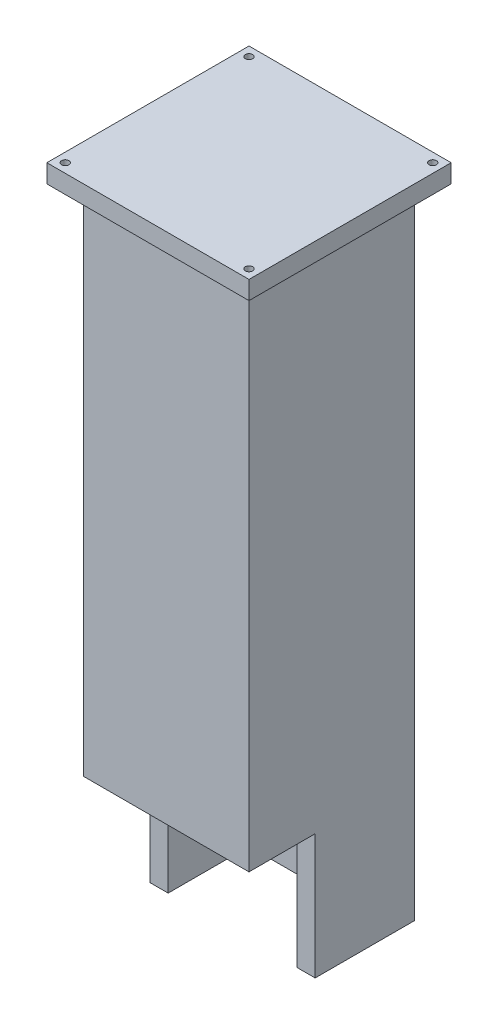
ISO-10303-21;
HEADER;
FILE_DESCRIPTION(('STEP AP214'),'2;1');
FILE_NAME('part.step','',(''),(''),'','','');
FILE_SCHEMA(('AUTOMOTIVE_DESIGN { 1 0 10303 214 1 1 1 1 }'));
ENDSEC;
DATA;
#1=APPLICATION_CONTEXT('core data for automotive mechanical design processes');
#2=APPLICATION_PROTOCOL_DEFINITION('international standard','automotive_design',2000,#1);
#3=PRODUCT_CONTEXT('',#1,'mechanical');
#4=PRODUCT('Part','Part','',(#3));
#5=PRODUCT_RELATED_PRODUCT_CATEGORY('part','',(#4));
#6=PRODUCT_DEFINITION_FORMATION('','',#4);
#7=PRODUCT_DEFINITION_CONTEXT('part definition',#1,'design');
#8=PRODUCT_DEFINITION('design','',#6,#7);
#9=PRODUCT_DEFINITION_SHAPE('','',#8);
#10=(LENGTH_UNIT() NAMED_UNIT(*) SI_UNIT(.MILLI.,.METRE.));
#11=(NAMED_UNIT(*) PLANE_ANGLE_UNIT() SI_UNIT($,.RADIAN.));
#12=(NAMED_UNIT(*) SI_UNIT($,.STERADIAN.) SOLID_ANGLE_UNIT());
#13=UNCERTAINTY_MEASURE_WITH_UNIT(LENGTH_MEASURE(1.E-05),#10,'distance_accuracy_value','');
#14=(GEOMETRIC_REPRESENTATION_CONTEXT(3) GLOBAL_UNCERTAINTY_ASSIGNED_CONTEXT((#13)) GLOBAL_UNIT_ASSIGNED_CONTEXT((#10,
#11,#12)) REPRESENTATION_CONTEXT('',''));
#15=CARTESIAN_POINT('',(0.,0.,0.));
#16=DIRECTION('',(0.,0.,1.));
#17=DIRECTION('',(1.,0.,0.));
#18=AXIS2_PLACEMENT_3D('',#15,#16,#17);
#19=CARTESIAN_POINT('',(0.,0.,0.));
#20=DIRECTION('',(0.,-1.,0.));
#21=DIRECTION('',(0.,0.,-1.));
#22=AXIS2_PLACEMENT_3D('',#19,#20,#21);
#23=PLANE('',#22);
#24=DIRECTION('',(1.,0.,0.));
#25=VECTOR('',#24,1.);
#26=CARTESIAN_POINT('',(-17.5,0.,-17.5));
#27=LINE('',#26,#25);
#28=CARTESIAN_POINT('',(-17.5,0.,-17.5));
#29=VERTEX_POINT('',#28);
#30=CARTESIAN_POINT('',(17.5,0.,-17.5));
#31=VERTEX_POINT('',#30);
#32=EDGE_CURVE('E224',#29,#31,#27,.T.);
#33=ORIENTED_EDGE('',*,*,#32,.F.);
#34=DIRECTION('',(0.,0.,-1.));
#35=VECTOR('',#34,1.);
#36=CARTESIAN_POINT('',(-17.5,0.,17.5));
#37=LINE('',#36,#35);
#38=CARTESIAN_POINT('',(-17.5,0.,4.5));
#39=VERTEX_POINT('',#38);
#40=EDGE_CURVE('E221',#39,#29,#37,.T.);
#41=ORIENTED_EDGE('',*,*,#40,.F.);
#42=DIRECTION('',(-1.,0.,0.));
#43=VECTOR('',#42,1.);
#44=CARTESIAN_POINT('',(22.5,0.,4.5));
#45=LINE('',#44,#43);
#46=CARTESIAN_POINT('',(-22.5,0.,4.50000000000001));
#47=VERTEX_POINT('',#46);
#48=EDGE_CURVE('E274',#39,#47,#45,.T.);
#49=ORIENTED_EDGE('',*,*,#48,.T.);
#50=DIRECTION('',(0.,0.,1.));
#51=VECTOR('',#50,1.);
#52=CARTESIAN_POINT('',(-22.5,0.,22.5));
#53=LINE('',#52,#51);
#54=CARTESIAN_POINT('',(-22.5,0.,-22.5));
#55=VERTEX_POINT('',#54);
#56=EDGE_CURVE('E290',#55,#47,#53,.T.);
#57=ORIENTED_EDGE('',*,*,#56,.F.);
#58=DIRECTION('',(-1.,0.,0.));
#59=VECTOR('',#58,1.);
#60=CARTESIAN_POINT('',(-22.5,0.,-22.5));
#61=LINE('',#60,#59);
#62=CARTESIAN_POINT('',(22.5,0.,-22.5));
#63=VERTEX_POINT('',#62);
#64=EDGE_CURVE('E286',#63,#55,#61,.T.);
#65=ORIENTED_EDGE('',*,*,#64,.F.);
#66=DIRECTION('',(0.,0.,-1.));
#67=VECTOR('',#66,1.);
#68=CARTESIAN_POINT('',(22.5,0.,22.5));
#69=LINE('',#68,#67);
#70=CARTESIAN_POINT('',(22.5,0.,4.5));
#71=VERTEX_POINT('',#70);
#72=EDGE_CURVE('E273',#71,#63,#69,.T.);
#73=ORIENTED_EDGE('',*,*,#72,.F.);
#74=CARTESIAN_POINT('',(17.5,0.,4.5));
#75=VERTEX_POINT('',#74);
#76=EDGE_CURVE('E269',#71,#75,#45,.T.);
#77=ORIENTED_EDGE('',*,*,#76,.T.);
#78=DIRECTION('',(0.,0.,-1.));
#79=VECTOR('',#78,1.);
#80=CARTESIAN_POINT('',(17.5,0.,17.5));
#81=LINE('',#80,#79);
#82=EDGE_CURVE('E227',#75,#31,#81,.T.);
#83=ORIENTED_EDGE('',*,*,#82,.T.);
#84=EDGE_LOOP('',(#33,#41,#49,#57,#65,#73,#77,#83));
#85=FACE_BOUND('',#84,.T.);
#86=ADVANCED_FACE('F47',(#85),#23,.T.);
#87=CARTESIAN_POINT('',(22.5,0.,4.5));
#88=DIRECTION('',(0.,0.,-1.));
#89=DIRECTION('',(-1.,0.,0.));
#90=AXIS2_PLACEMENT_3D('',#87,#88,#89);
#91=PLANE('',#90);
#92=DIRECTION('',(0.,-1.,0.));
#93=VECTOR('',#92,1.);
#94=CARTESIAN_POINT('',(-17.5,0.,4.5));
#95=LINE('',#94,#93);
#96=CARTESIAN_POINT('',(-17.5,34.,4.5));
#97=VERTEX_POINT('',#96);
#98=EDGE_CURVE('E249',#97,#39,#95,.T.);
#99=ORIENTED_EDGE('',*,*,#98,.F.);
#100=DIRECTION('',(-1.,0.,0.));
#101=VECTOR('',#100,1.);
#102=CARTESIAN_POINT('',(22.5,34.,4.5));
#103=LINE('',#102,#101);
#104=CARTESIAN_POINT('',(-22.5,34.,4.5));
#105=VERTEX_POINT('',#104);
#106=EDGE_CURVE('E279',#97,#105,#103,.T.);
#107=ORIENTED_EDGE('',*,*,#106,.T.);
#108=DIRECTION('',(0.,-1.,0.));
#109=VECTOR('',#108,1.);
#110=CARTESIAN_POINT('',(-22.5,0.,4.5));
#111=LINE('',#110,#109);
#112=EDGE_CURVE('E258',#105,#47,#111,.T.);
#113=ORIENTED_EDGE('',*,*,#112,.T.);
#114=ORIENTED_EDGE('',*,*,#48,.F.);
#115=EDGE_LOOP('',(#99,#107,#113,#114));
#116=FACE_BOUND('',#115,.T.);
#117=ADVANCED_FACE('F326',(#116),#91,.F.);
#118=CARTESIAN_POINT('',(22.5,34.,4.5));
#119=DIRECTION('',(0.,1.,0.));
#120=DIRECTION('',(0.,0.,1.));
#121=AXIS2_PLACEMENT_3D('',#118,#119,#120);
#122=PLANE('',#121);
#123=DIRECTION('',(0.,0.,-1.));
#124=VECTOR('',#123,1.);
#125=CARTESIAN_POINT('',(-17.5,34.,4.5));
#126=LINE('',#125,#124);
#127=CARTESIAN_POINT('',(-17.5,34.,17.5));
#128=VERTEX_POINT('',#127);
#129=EDGE_CURVE('E56',#128,#97,#126,.T.);
#130=ORIENTED_EDGE('',*,*,#129,.F.);
#131=DIRECTION('',(1.,0.,0.));
#132=VECTOR('',#131,1.);
#133=CARTESIAN_POINT('',(22.5,34.,17.5));
#134=LINE('',#133,#132);
#135=CARTESIAN_POINT('',(17.5,34.,17.5));
#136=VERTEX_POINT('',#135);
#137=EDGE_CURVE('E306',#128,#136,#134,.T.);
#138=ORIENTED_EDGE('',*,*,#137,.T.);
#139=DIRECTION('',(0.,0.,-1.));
#140=VECTOR('',#139,1.);
#141=CARTESIAN_POINT('',(17.5,34.,4.5));
#142=LINE('',#141,#140);
#143=CARTESIAN_POINT('',(17.5,34.,4.5));
#144=VERTEX_POINT('',#143);
#145=EDGE_CURVE('E310',#136,#144,#142,.T.);
#146=ORIENTED_EDGE('',*,*,#145,.T.);
#147=CARTESIAN_POINT('',(22.5,34.,4.5));
#148=VERTEX_POINT('',#147);
#149=EDGE_CURVE('E275',#148,#144,#103,.T.);
#150=ORIENTED_EDGE('',*,*,#149,.F.);
#151=DIRECTION('',(0.,0.,-1.));
#152=VECTOR('',#151,1.);
#153=CARTESIAN_POINT('',(22.5,34.,4.5));
#154=LINE('',#153,#152);
#155=CARTESIAN_POINT('',(22.5,34.,22.5));
#156=VERTEX_POINT('',#155);
#157=EDGE_CURVE('E253',#156,#148,#154,.T.);
#158=ORIENTED_EDGE('',*,*,#157,.F.);
#159=DIRECTION('',(-1.,0.,0.));
#160=VECTOR('',#159,1.);
#161=CARTESIAN_POINT('',(22.5,34.,22.5));
#162=LINE('',#161,#160);
#163=CARTESIAN_POINT('',(-22.5,34.,22.5));
#164=VERTEX_POINT('',#163);
#165=EDGE_CURVE('E262',#156,#164,#162,.T.);
#166=ORIENTED_EDGE('',*,*,#165,.T.);
#167=DIRECTION('',(0.,0.,-1.));
#168=VECTOR('',#167,1.);
#169=CARTESIAN_POINT('',(-22.5,34.,4.5));
#170=LINE('',#169,#168);
#171=EDGE_CURVE('E252',#164,#105,#170,.T.);
#172=ORIENTED_EDGE('',*,*,#171,.T.);
#173=ORIENTED_EDGE('',*,*,#106,.F.);
#174=EDGE_LOOP('',(#130,#138,#146,#150,#158,#166,#172,#173));
#175=FACE_BOUND('',#174,.T.);
#176=ADVANCED_FACE('F327',(#175),#122,.F.);
#177=CARTESIAN_POINT('',(22.5,300.,22.5));
#178=DIRECTION('',(-1.,0.,0.));
#179=DIRECTION('',(0.,0.,1.));
#180=AXIS2_PLACEMENT_3D('',#177,#178,#179);
#181=PLANE('',#180);
#182=DIRECTION('',(0.,-1.,0.));
#183=VECTOR('',#182,1.);
#184=CARTESIAN_POINT('',(22.5,300.,-22.5));
#185=LINE('',#184,#183);
#186=CARTESIAN_POINT('',(22.5,173.612120728358,-22.5));
#187=VERTEX_POINT('',#186);
#188=EDGE_CURVE('E303',#187,#63,#185,.T.);
#189=ORIENTED_EDGE('',*,*,#188,.F.);
#190=DIRECTION('',(0.,0.,-1.));
#191=VECTOR('',#190,1.);
#192=CARTESIAN_POINT('',(22.5,173.612120728358,22.5));
#193=LINE('',#192,#191);
#194=CARTESIAN_POINT('',(22.5,173.612120728358,22.5));
#195=VERTEX_POINT('',#194);
#196=EDGE_CURVE('E191',#195,#187,#193,.T.);
#197=ORIENTED_EDGE('',*,*,#196,.F.);
#198=DIRECTION('',(0.,-1.,0.));
#199=VECTOR('',#198,1.);
#200=CARTESIAN_POINT('',(22.5,300.,22.5));
#201=LINE('',#200,#199);
#202=EDGE_CURVE('E294',#195,#156,#201,.T.);
#203=ORIENTED_EDGE('',*,*,#202,.T.);
#204=ORIENTED_EDGE('',*,*,#157,.T.);
#205=DIRECTION('',(0.,-1.,0.));
#206=VECTOR('',#205,1.);
#207=CARTESIAN_POINT('',(22.5,0.,4.5));
#208=LINE('',#207,#206);
#209=EDGE_CURVE('E257',#148,#71,#208,.T.);
#210=ORIENTED_EDGE('',*,*,#209,.T.);
#211=ORIENTED_EDGE('',*,*,#72,.T.);
#212=EDGE_LOOP('',(#189,#197,#203,#204,#210,#211));
#213=FACE_BOUND('',#212,.T.);
#214=ADVANCED_FACE('F49',(#213),#181,.F.);
#215=CARTESIAN_POINT('',(-22.5,300.,-22.5));
#216=DIRECTION('',(0.,0.,1.));
#217=DIRECTION('',(1.,0.,0.));
#218=AXIS2_PLACEMENT_3D('',#215,#216,#217);
#219=PLANE('',#218);
#220=DIRECTION('',(0.,-1.,0.));
#221=VECTOR('',#220,1.);
#222=CARTESIAN_POINT('',(-22.5,300.,-22.5));
#223=LINE('',#222,#221);
#224=CARTESIAN_POINT('',(-22.5,173.612120728358,-22.5));
#225=VERTEX_POINT('',#224);
#226=EDGE_CURVE('E300',#225,#55,#223,.T.);
#227=ORIENTED_EDGE('',*,*,#226,.F.);
#228=DIRECTION('',(1.,0.,0.));
#229=VECTOR('',#228,1.);
#230=CARTESIAN_POINT('',(-22.5,173.612120728358,-22.5));
#231=LINE('',#230,#229);
#232=EDGE_CURVE('E205',#225,#187,#231,.T.);
#233=ORIENTED_EDGE('',*,*,#232,.T.);
#234=ORIENTED_EDGE('',*,*,#188,.T.);
#235=ORIENTED_EDGE('',*,*,#64,.T.);
#236=EDGE_LOOP('',(#227,#233,#234,#235));
#237=FACE_BOUND('',#236,.T.);
#238=ADVANCED_FACE('F477',(#237),#219,.F.);
#239=CARTESIAN_POINT('',(-22.5,300.,22.5));
#240=DIRECTION('',(1.,0.,0.));
#241=DIRECTION('',(0.,0.,-1.));
#242=AXIS2_PLACEMENT_3D('',#239,#240,#241);
#243=PLANE('',#242);
#244=DIRECTION('',(0.,-1.,0.));
#245=VECTOR('',#244,1.);
#246=CARTESIAN_POINT('',(-22.5,300.,22.5));
#247=LINE('',#246,#245);
#248=CARTESIAN_POINT('',(-22.5,173.612120728358,22.5));
#249=VERTEX_POINT('',#248);
#250=EDGE_CURVE('E297',#249,#164,#247,.T.);
#251=ORIENTED_EDGE('',*,*,#250,.F.);
#252=DIRECTION('',(0.,0.,-1.));
#253=VECTOR('',#252,1.);
#254=CARTESIAN_POINT('',(-22.5,173.612120728358,22.5));
#255=LINE('',#254,#253);
#256=EDGE_CURVE('E197',#249,#225,#255,.T.);
#257=ORIENTED_EDGE('',*,*,#256,.T.);
#258=ORIENTED_EDGE('',*,*,#226,.T.);
#259=ORIENTED_EDGE('',*,*,#56,.T.);
#260=ORIENTED_EDGE('',*,*,#112,.F.);
#261=ORIENTED_EDGE('',*,*,#171,.F.);
#262=EDGE_LOOP('',(#251,#257,#258,#259,#260,#261));
#263=FACE_BOUND('',#262,.T.);
#264=ADVANCED_FACE('F475',(#263),#243,.F.);
#265=CARTESIAN_POINT('',(-22.5,300.,22.5));
#266=DIRECTION('',(0.,0.,-1.));
#267=DIRECTION('',(-1.,0.,0.));
#268=AXIS2_PLACEMENT_3D('',#265,#266,#267);
#269=PLANE('',#268);
#270=ORIENTED_EDGE('',*,*,#202,.F.);
#271=DIRECTION('',(1.,0.,0.));
#272=VECTOR('',#271,1.);
#273=CARTESIAN_POINT('',(-22.5,173.612120728358,22.5));
#274=LINE('',#273,#272);
#275=EDGE_CURVE('E63',#249,#195,#274,.T.);
#276=ORIENTED_EDGE('',*,*,#275,.F.);
#277=ORIENTED_EDGE('',*,*,#250,.T.);
#278=ORIENTED_EDGE('',*,*,#165,.F.);
#279=EDGE_LOOP('',(#270,#276,#277,#278));
#280=FACE_BOUND('',#279,.T.);
#281=ADVANCED_FACE('F472',(#280),#269,.F.);
#282=ORIENTED_EDGE('',*,*,#149,.T.);
#283=DIRECTION('',(0.,-1.,0.));
#284=VECTOR('',#283,1.);
#285=CARTESIAN_POINT('',(17.5,0.,4.5));
#286=LINE('',#285,#284);
#287=EDGE_CURVE('E245',#144,#75,#286,.T.);
#288=ORIENTED_EDGE('',*,*,#287,.T.);
#289=ORIENTED_EDGE('',*,*,#76,.F.);
#290=ORIENTED_EDGE('',*,*,#209,.F.);
#291=EDGE_LOOP('',(#282,#288,#289,#290));
#292=FACE_BOUND('',#291,.T.);
#293=ADVANCED_FACE('F468',(#292),#91,.F.);
#294=CARTESIAN_POINT('',(-17.5,0.,17.5));
#295=DIRECTION('',(1.,0.,0.));
#296=DIRECTION('',(0.,0.,-1.));
#297=AXIS2_PLACEMENT_3D('',#294,#295,#296);
#298=PLANE('',#297);
#299=DIRECTION('',(0.,0.,-1.));
#300=VECTOR('',#299,1.);
#301=CARTESIAN_POINT('',(-17.5,173.612120728358,17.5));
#302=LINE('',#301,#300);
#303=CARTESIAN_POINT('',(-17.5,173.612120728358,17.5));
#304=VERTEX_POINT('',#303);
#305=CARTESIAN_POINT('',(-17.5,173.612120728358,-17.5));
#306=VERTEX_POINT('',#305);
#307=EDGE_CURVE('E215',#304,#306,#302,.T.);
#308=ORIENTED_EDGE('',*,*,#307,.F.);
#309=DIRECTION('',(0.,1.,0.));
#310=VECTOR('',#309,1.);
#311=CARTESIAN_POINT('',(-17.5,0.,17.5));
#312=LINE('',#311,#310);
#313=EDGE_CURVE('E231',#128,#304,#312,.T.);
#314=ORIENTED_EDGE('',*,*,#313,.F.);
#315=ORIENTED_EDGE('',*,*,#129,.T.);
#316=ORIENTED_EDGE('',*,*,#98,.T.);
#317=ORIENTED_EDGE('',*,*,#40,.T.);
#318=DIRECTION('',(0.,1.,0.));
#319=VECTOR('',#318,1.);
#320=CARTESIAN_POINT('',(-17.5,0.,-17.5));
#321=LINE('',#320,#319);
#322=EDGE_CURVE('E241',#29,#306,#321,.T.);
#323=ORIENTED_EDGE('',*,*,#322,.T.);
#324=EDGE_LOOP('',(#308,#314,#315,#316,#317,#323));
#325=FACE_BOUND('',#324,.T.);
#326=ADVANCED_FACE('F320',(#325),#298,.T.);
#327=CARTESIAN_POINT('',(17.5,0.,17.5));
#328=DIRECTION('',(1.,0.,0.));
#329=DIRECTION('',(0.,0.,-1.));
#330=AXIS2_PLACEMENT_3D('',#327,#328,#329);
#331=PLANE('',#330);
#332=DIRECTION('',(0.,1.,0.));
#333=VECTOR('',#332,1.);
#334=CARTESIAN_POINT('',(17.5,0.,17.5));
#335=LINE('',#334,#333);
#336=CARTESIAN_POINT('',(17.5,173.612120728358,17.5));
#337=VERTEX_POINT('',#336);
#338=EDGE_CURVE('E71',#136,#337,#335,.T.);
#339=ORIENTED_EDGE('',*,*,#338,.T.);
#340=DIRECTION('',(0.,0.,-1.));
#341=VECTOR('',#340,1.);
#342=CARTESIAN_POINT('',(17.5,173.612120728358,17.5));
#343=LINE('',#342,#341);
#344=CARTESIAN_POINT('',(17.5,173.612120728358,-17.5));
#345=VERTEX_POINT('',#344);
#346=EDGE_CURVE('E209',#337,#345,#343,.T.);
#347=ORIENTED_EDGE('',*,*,#346,.T.);
#348=DIRECTION('',(0.,1.,0.));
#349=VECTOR('',#348,1.);
#350=CARTESIAN_POINT('',(17.5,0.,-17.5));
#351=LINE('',#350,#349);
#352=EDGE_CURVE('E237',#31,#345,#351,.T.);
#353=ORIENTED_EDGE('',*,*,#352,.F.);
#354=ORIENTED_EDGE('',*,*,#82,.F.);
#355=ORIENTED_EDGE('',*,*,#287,.F.);
#356=ORIENTED_EDGE('',*,*,#145,.F.);
#357=EDGE_LOOP('',(#339,#347,#353,#354,#355,#356));
#358=FACE_BOUND('',#357,.T.);
#359=ADVANCED_FACE('F502',(#358),#331,.F.);
#360=CARTESIAN_POINT('',(-17.5,0.,17.5));
#361=DIRECTION('',(0.,0.,1.));
#362=DIRECTION('',(1.,0.,0.));
#363=AXIS2_PLACEMENT_3D('',#360,#361,#362);
#364=PLANE('',#363);
#365=ORIENTED_EDGE('',*,*,#313,.T.);
#366=DIRECTION('',(1.,0.,0.));
#367=VECTOR('',#366,1.);
#368=CARTESIAN_POINT('',(-17.5,173.612120728358,17.5));
#369=LINE('',#368,#367);
#370=EDGE_CURVE('E218',#304,#337,#369,.T.);
#371=ORIENTED_EDGE('',*,*,#370,.T.);
#372=ORIENTED_EDGE('',*,*,#338,.F.);
#373=ORIENTED_EDGE('',*,*,#137,.F.);
#374=EDGE_LOOP('',(#365,#371,#372,#373));
#375=FACE_BOUND('',#374,.T.);
#376=ADVANCED_FACE('F503',(#375),#364,.F.);
#377=CARTESIAN_POINT('',(-17.5,0.,-17.5));
#378=DIRECTION('',(0.,0.,1.));
#379=DIRECTION('',(1.,0.,0.));
#380=AXIS2_PLACEMENT_3D('',#377,#378,#379);
#381=PLANE('',#380);
#382=DIRECTION('',(1.,0.,0.));
#383=VECTOR('',#382,1.);
#384=CARTESIAN_POINT('',(-17.5,173.612120728358,-17.5));
#385=LINE('',#384,#383);
#386=EDGE_CURVE('E11',#306,#345,#385,.T.);
#387=ORIENTED_EDGE('',*,*,#386,.F.);
#388=ORIENTED_EDGE('',*,*,#322,.F.);
#389=ORIENTED_EDGE('',*,*,#32,.T.);
#390=ORIENTED_EDGE('',*,*,#352,.T.);
#391=EDGE_LOOP('',(#387,#388,#389,#390));
#392=FACE_BOUND('',#391,.T.);
#393=ADVANCED_FACE('F497',(#392),#381,.T.);
#394=CARTESIAN_POINT('',(0.,173.612120728358,0.));
#395=DIRECTION('',(0.,-1.,0.));
#396=DIRECTION('',(0.,0.,-1.));
#397=AXIS2_PLACEMENT_3D('',#394,#395,#396);
#398=PLANE('',#397);
#399=ORIENTED_EDGE('',*,*,#370,.F.);
#400=ORIENTED_EDGE('',*,*,#307,.T.);
#401=ORIENTED_EDGE('',*,*,#386,.T.);
#402=ORIENTED_EDGE('',*,*,#346,.F.);
#403=EDGE_LOOP('',(#399,#400,#401,#402));
#404=FACE_BOUND('',#403,.T.);
#405=ADVANCED_FACE('F500',(#404),#398,.T.);
#406=CARTESIAN_POINT('',(25.,173.612120728358,-25.));
#407=DIRECTION('',(0.,1.,0.));
#408=DIRECTION('',(0.,0.,1.));
#409=AXIS2_PLACEMENT_3D('',#406,#407,#408);
#410=CIRCLE('',#409,1.);
#411=CARTESIAN_POINT('',(25.,173.612120728358,-24.));
#412=VERTEX_POINT('',#411);
#413=EDGE_CURVE('E374',#412,#412,#410,.T.);
#414=ORIENTED_EDGE('',*,*,#413,.T.);
#415=EDGE_LOOP('',(#414));
#416=FACE_BOUND('',#415,.T.);
#417=CARTESIAN_POINT('',(-25.,173.612120728358,-25.));
#418=DIRECTION('',(0.,1.,0.));
#419=DIRECTION('',(0.,0.,1.));
#420=AXIS2_PLACEMENT_3D('',#417,#418,#419);
#421=CIRCLE('',#420,1.);
#422=CARTESIAN_POINT('',(-25.,173.612120728358,-24.));
#423=VERTEX_POINT('',#422);
#424=EDGE_CURVE('E386',#423,#423,#421,.T.);
#425=ORIENTED_EDGE('',*,*,#424,.T.);
#426=EDGE_LOOP('',(#425));
#427=FACE_BOUND('',#426,.T.);
#428=DIRECTION('',(0.,0.,-1.));
#429=VECTOR('',#428,1.);
#430=CARTESIAN_POINT('',(27.5,173.612120728358,27.5));
#431=LINE('',#430,#429);
#432=CARTESIAN_POINT('',(27.5,173.612120728358,27.5));
#433=VERTEX_POINT('',#432);
#434=CARTESIAN_POINT('',(27.5,173.612120728358,-27.5));
#435=VERTEX_POINT('',#434);
#436=EDGE_CURVE('E189',#433,#435,#431,.T.);
#437=ORIENTED_EDGE('',*,*,#436,.F.);
#438=DIRECTION('',(1.,0.,0.));
#439=VECTOR('',#438,1.);
#440=CARTESIAN_POINT('',(-27.5,173.612120728358,27.5));
#441=LINE('',#440,#439);
#442=CARTESIAN_POINT('',(-27.5,173.612120728358,27.5));
#443=VERTEX_POINT('',#442);
#444=EDGE_CURVE('E185',#443,#433,#441,.T.);
#445=ORIENTED_EDGE('',*,*,#444,.F.);
#446=DIRECTION('',(0.,0.,1.));
#447=VECTOR('',#446,1.);
#448=CARTESIAN_POINT('',(-27.5,173.612120728358,27.5));
#449=LINE('',#448,#447);
#450=CARTESIAN_POINT('',(-27.5,173.612120728358,-27.5));
#451=VERTEX_POINT('',#450);
#452=EDGE_CURVE('E403',#451,#443,#449,.T.);
#453=ORIENTED_EDGE('',*,*,#452,.F.);
#454=DIRECTION('',(-1.,0.,0.));
#455=VECTOR('',#454,1.);
#456=CARTESIAN_POINT('',(-27.5,173.612120728358,-27.5));
#457=LINE('',#456,#455);
#458=EDGE_CURVE('E405',#435,#451,#457,.T.);
#459=ORIENTED_EDGE('',*,*,#458,.F.);
#460=EDGE_LOOP('',(#437,#445,#453,#459));
#461=FACE_BOUND('',#460,.T.);
#462=CARTESIAN_POINT('',(25.,173.612120728358,25.));
#463=DIRECTION('',(0.,1.,0.));
#464=DIRECTION('',(0.,0.,1.));
#465=AXIS2_PLACEMENT_3D('',#462,#463,#464);
#466=CIRCLE('',#465,1.);
#467=CARTESIAN_POINT('',(25.,173.612120728358,26.));
#468=VERTEX_POINT('',#467);
#469=EDGE_CURVE('E390',#468,#468,#466,.T.);
#470=ORIENTED_EDGE('',*,*,#469,.T.);
#471=EDGE_LOOP('',(#470));
#472=FACE_BOUND('',#471,.T.);
#473=CARTESIAN_POINT('',(-25.,173.612120728358,25.));
#474=DIRECTION('',(0.,1.,0.));
#475=DIRECTION('',(0.,0.,1.));
#476=AXIS2_PLACEMENT_3D('',#473,#474,#475);
#477=CIRCLE('',#476,1.);
#478=CARTESIAN_POINT('',(-25.,173.612120728358,26.));
#479=VERTEX_POINT('',#478);
#480=EDGE_CURVE('E423',#479,#479,#477,.T.);
#481=ORIENTED_EDGE('',*,*,#480,.T.);
#482=EDGE_LOOP('',(#481));
#483=FACE_BOUND('',#482,.T.);
#484=ORIENTED_EDGE('',*,*,#232,.F.);
#485=ORIENTED_EDGE('',*,*,#256,.F.);
#486=ORIENTED_EDGE('',*,*,#275,.T.);
#487=ORIENTED_EDGE('',*,*,#196,.T.);
#488=EDGE_LOOP('',(#484,#485,#486,#487));
#489=FACE_BOUND('',#488,.T.);
#490=ADVANCED_FACE('F442',(#416,#427,#461,#472,#483,#489),#398,.T.);
#491=CARTESIAN_POINT('',(0.,178.612120728358,0.));
#492=DIRECTION('',(0.,-1.,0.));
#493=DIRECTION('',(0.,0.,-1.));
#494=AXIS2_PLACEMENT_3D('',#491,#492,#493);
#495=PLANE('',#494);
#496=DIRECTION('',(0.,0.,-1.));
#497=VECTOR('',#496,1.);
#498=CARTESIAN_POINT('',(27.5,178.612120728358,27.5));
#499=LINE('',#498,#497);
#500=CARTESIAN_POINT('',(27.5,178.612120728358,27.5));
#501=VERTEX_POINT('',#500);
#502=CARTESIAN_POINT('',(27.5,178.612120728358,-27.5));
#503=VERTEX_POINT('',#502);
#504=EDGE_CURVE('E174',#501,#503,#499,.T.);
#505=ORIENTED_EDGE('',*,*,#504,.T.);
#506=DIRECTION('',(-1.,0.,0.));
#507=VECTOR('',#506,1.);
#508=CARTESIAN_POINT('',(-27.5,178.612120728358,-27.5));
#509=LINE('',#508,#507);
#510=CARTESIAN_POINT('',(-27.5,178.612120728358,-27.5));
#511=VERTEX_POINT('',#510);
#512=EDGE_CURVE('E162',#503,#511,#509,.T.);
#513=ORIENTED_EDGE('',*,*,#512,.T.);
#514=DIRECTION('',(0.,0.,1.));
#515=VECTOR('',#514,1.);
#516=CARTESIAN_POINT('',(-27.5,178.612120728358,27.5));
#517=LINE('',#516,#515);
#518=CARTESIAN_POINT('',(-27.5,178.612120728358,27.5));
#519=VERTEX_POINT('',#518);
#520=EDGE_CURVE('E173',#511,#519,#517,.T.);
#521=ORIENTED_EDGE('',*,*,#520,.T.);
#522=DIRECTION('',(1.,0.,0.));
#523=VECTOR('',#522,1.);
#524=CARTESIAN_POINT('',(-27.5,178.612120728358,27.5));
#525=LINE('',#524,#523);
#526=EDGE_CURVE('E180',#519,#501,#525,.T.);
#527=ORIENTED_EDGE('',*,*,#526,.T.);
#528=EDGE_LOOP('',(#505,#513,#521,#527));
#529=FACE_BOUND('',#528,.T.);
#530=CARTESIAN_POINT('',(-25.,178.612120728358,-25.));
#531=DIRECTION('',(0.,1.,0.));
#532=DIRECTION('',(0.,0.,1.));
#533=AXIS2_PLACEMENT_3D('',#530,#531,#532);
#534=CIRCLE('',#533,1.);
#535=CARTESIAN_POINT('',(-25.,178.612120728358,-24.));
#536=VERTEX_POINT('',#535);
#537=EDGE_CURVE('E383',#536,#536,#534,.T.);
#538=ORIENTED_EDGE('',*,*,#537,.F.);
#539=EDGE_LOOP('',(#538));
#540=FACE_BOUND('',#539,.T.);
#541=CARTESIAN_POINT('',(25.,178.612120728358,25.));
#542=DIRECTION('',(0.,1.,0.));
#543=DIRECTION('',(0.,0.,1.));
#544=AXIS2_PLACEMENT_3D('',#541,#542,#543);
#545=CIRCLE('',#544,1.);
#546=CARTESIAN_POINT('',(25.,178.612120728358,26.));
#547=VERTEX_POINT('',#546);
#548=EDGE_CURVE('E393',#547,#547,#545,.T.);
#549=ORIENTED_EDGE('',*,*,#548,.F.);
#550=EDGE_LOOP('',(#549));
#551=FACE_BOUND('',#550,.T.);
#552=CARTESIAN_POINT('',(25.,178.612120728358,-25.));
#553=DIRECTION('',(0.,1.,0.));
#554=DIRECTION('',(0.,0.,1.));
#555=AXIS2_PLACEMENT_3D('',#552,#553,#554);
#556=CIRCLE('',#555,1.);
#557=CARTESIAN_POINT('',(25.,178.612120728358,-24.));
#558=VERTEX_POINT('',#557);
#559=EDGE_CURVE('E378',#558,#558,#556,.T.);
#560=ORIENTED_EDGE('',*,*,#559,.F.);
#561=EDGE_LOOP('',(#560));
#562=FACE_BOUND('',#561,.T.);
#563=CARTESIAN_POINT('',(-25.,178.612120728358,25.));
#564=DIRECTION('',(0.,1.,0.));
#565=DIRECTION('',(0.,0.,1.));
#566=AXIS2_PLACEMENT_3D('',#563,#564,#565);
#567=CIRCLE('',#566,1.);
#568=CARTESIAN_POINT('',(-25.,178.612120728358,26.));
#569=VERTEX_POINT('',#568);
#570=EDGE_CURVE('E379',#569,#569,#567,.T.);
#571=ORIENTED_EDGE('',*,*,#570,.F.);
#572=EDGE_LOOP('',(#571));
#573=FACE_BOUND('',#572,.T.);
#574=ADVANCED_FACE('F177',(#529,#540,#551,#562,#573),#495,.F.);
#575=CARTESIAN_POINT('',(27.5,178.612120728358,27.5));
#576=DIRECTION('',(-1.,0.,0.));
#577=DIRECTION('',(0.,0.,1.));
#578=AXIS2_PLACEMENT_3D('',#575,#576,#577);
#579=PLANE('',#578);
#580=ORIENTED_EDGE('',*,*,#436,.T.);
#581=DIRECTION('',(0.,-1.,0.));
#582=VECTOR('',#581,1.);
#583=CARTESIAN_POINT('',(27.5,178.612120728358,-27.5));
#584=LINE('',#583,#582);
#585=EDGE_CURVE('E166',#503,#435,#584,.T.);
#586=ORIENTED_EDGE('',*,*,#585,.F.);
#587=ORIENTED_EDGE('',*,*,#504,.F.);
#588=DIRECTION('',(0.,-1.,0.));
#589=VECTOR('',#588,1.);
#590=CARTESIAN_POINT('',(27.5,178.612120728358,27.5));
#591=LINE('',#590,#589);
#592=EDGE_CURVE('E417',#501,#433,#591,.T.);
#593=ORIENTED_EDGE('',*,*,#592,.T.);
#594=EDGE_LOOP('',(#580,#586,#587,#593));
#595=FACE_BOUND('',#594,.T.);
#596=ADVANCED_FACE('F187',(#595),#579,.F.);
#597=CARTESIAN_POINT('',(-27.5,178.612120728358,-27.5));
#598=DIRECTION('',(0.,0.,1.));
#599=DIRECTION('',(1.,0.,0.));
#600=AXIS2_PLACEMENT_3D('',#597,#598,#599);
#601=PLANE('',#600);
#602=ORIENTED_EDGE('',*,*,#458,.T.);
#603=DIRECTION('',(0.,-1.,0.));
#604=VECTOR('',#603,1.);
#605=CARTESIAN_POINT('',(-27.5,178.612120728358,-27.5));
#606=LINE('',#605,#604);
#607=EDGE_CURVE('E169',#511,#451,#606,.T.);
#608=ORIENTED_EDGE('',*,*,#607,.F.);
#609=ORIENTED_EDGE('',*,*,#512,.F.);
#610=ORIENTED_EDGE('',*,*,#585,.T.);
#611=EDGE_LOOP('',(#602,#608,#609,#610));
#612=FACE_BOUND('',#611,.T.);
#613=ADVANCED_FACE('F164',(#612),#601,.F.);
#614=CARTESIAN_POINT('',(-27.5,178.612120728358,27.5));
#615=DIRECTION('',(1.,0.,0.));
#616=DIRECTION('',(0.,0.,-1.));
#617=AXIS2_PLACEMENT_3D('',#614,#615,#616);
#618=PLANE('',#617);
#619=ORIENTED_EDGE('',*,*,#452,.T.);
#620=DIRECTION('',(0.,-1.,0.));
#621=VECTOR('',#620,1.);
#622=CARTESIAN_POINT('',(-27.5,178.612120728358,27.5));
#623=LINE('',#622,#621);
#624=EDGE_CURVE('E199',#519,#443,#623,.T.);
#625=ORIENTED_EDGE('',*,*,#624,.F.);
#626=ORIENTED_EDGE('',*,*,#520,.F.);
#627=ORIENTED_EDGE('',*,*,#607,.T.);
#628=EDGE_LOOP('',(#619,#625,#626,#627));
#629=FACE_BOUND('',#628,.T.);
#630=ADVANCED_FACE('F446',(#629),#618,.F.);
#631=CARTESIAN_POINT('',(-27.5,178.612120728358,27.5));
#632=DIRECTION('',(0.,0.,-1.));
#633=DIRECTION('',(-1.,0.,0.));
#634=AXIS2_PLACEMENT_3D('',#631,#632,#633);
#635=PLANE('',#634);
#636=ORIENTED_EDGE('',*,*,#444,.T.);
#637=ORIENTED_EDGE('',*,*,#592,.F.);
#638=ORIENTED_EDGE('',*,*,#526,.F.);
#639=ORIENTED_EDGE('',*,*,#624,.T.);
#640=EDGE_LOOP('',(#636,#637,#638,#639));
#641=FACE_BOUND('',#640,.T.);
#642=ADVANCED_FACE('F448',(#641),#635,.F.);
#643=CARTESIAN_POINT('',(-25.,178.612120728358,-25.));
#644=DIRECTION('',(0.,-1.,0.));
#645=DIRECTION('',(0.,0.,-1.));
#646=AXIS2_PLACEMENT_3D('',#643,#644,#645);
#647=CYLINDRICAL_SURFACE('',#646,1.);
#648=ORIENTED_EDGE('',*,*,#537,.T.);
#649=EDGE_LOOP('',(#648));
#650=FACE_BOUND('',#649,.T.);
#651=ORIENTED_EDGE('',*,*,#424,.F.);
#652=EDGE_LOOP('',(#651));
#653=FACE_BOUND('',#652,.T.);
#654=ADVANCED_FACE('F450',(#650,#653),#647,.F.);
#655=CARTESIAN_POINT('',(25.,178.612120728358,25.));
#656=DIRECTION('',(0.,-1.,0.));
#657=DIRECTION('',(0.,0.,-1.));
#658=AXIS2_PLACEMENT_3D('',#655,#656,#657);
#659=CYLINDRICAL_SURFACE('',#658,1.);
#660=ORIENTED_EDGE('',*,*,#548,.T.);
#661=EDGE_LOOP('',(#660));
#662=FACE_BOUND('',#661,.T.);
#663=ORIENTED_EDGE('',*,*,#469,.F.);
#664=EDGE_LOOP('',(#663));
#665=FACE_BOUND('',#664,.T.);
#666=ADVANCED_FACE('F456',(#662,#665),#659,.F.);
#667=CARTESIAN_POINT('',(25.,178.612120728358,-25.));
#668=DIRECTION('',(0.,-1.,0.));
#669=DIRECTION('',(0.,0.,-1.));
#670=AXIS2_PLACEMENT_3D('',#667,#668,#669);
#671=CYLINDRICAL_SURFACE('',#670,1.);
#672=ORIENTED_EDGE('',*,*,#559,.T.);
#673=EDGE_LOOP('',(#672));
#674=FACE_BOUND('',#673,.T.);
#675=ORIENTED_EDGE('',*,*,#413,.F.);
#676=EDGE_LOOP('',(#675));
#677=FACE_BOUND('',#676,.T.);
#678=ADVANCED_FACE('F589',(#674,#677),#671,.F.);
#679=CARTESIAN_POINT('',(-25.,178.612120728358,25.));
#680=DIRECTION('',(0.,-1.,0.));
#681=DIRECTION('',(0.,0.,-1.));
#682=AXIS2_PLACEMENT_3D('',#679,#680,#681);
#683=CYLINDRICAL_SURFACE('',#682,1.);
#684=ORIENTED_EDGE('',*,*,#570,.T.);
#685=EDGE_LOOP('',(#684));
#686=FACE_BOUND('',#685,.T.);
#687=ORIENTED_EDGE('',*,*,#480,.F.);
#688=EDGE_LOOP('',(#687));
#689=FACE_BOUND('',#688,.T.);
#690=ADVANCED_FACE('F598',(#686,#689),#683,.F.);
#691=CLOSED_SHELL('',(#86,#117,#176,#214,#238,#264,#281,#293,#326,#359,#376,#393,#405,#490,#574,
#596,#613,#630,#642,#654,#666,#678,#690));
#692=MANIFOLD_SOLID_BREP('B2',#691);
#693=ADVANCED_BREP_SHAPE_REPRESENTATION('',(#18,#692),#14);
#694=SHAPE_DEFINITION_REPRESENTATION(#9,#693);
ENDSEC;
END-ISO-10303-21;
